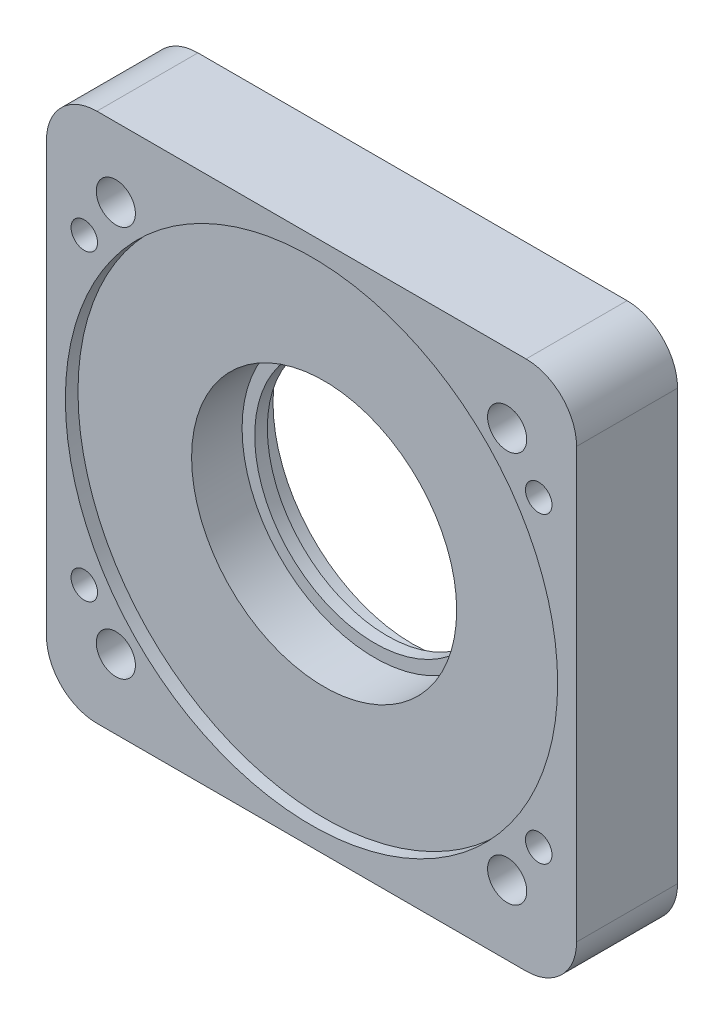
ISO-10303-21;
HEADER;
FILE_DESCRIPTION(('STEP AP214'),'2;1');
FILE_NAME('part.step','',(''),(''),'','','');
FILE_SCHEMA(('AUTOMOTIVE_DESIGN { 1 0 10303 214 1 1 1 1 }'));
ENDSEC;
DATA;
#1=APPLICATION_CONTEXT('core data for automotive mechanical design processes');
#2=APPLICATION_PROTOCOL_DEFINITION('international standard','automotive_design',2000,#1);
#3=PRODUCT_CONTEXT('',#1,'mechanical');
#4=PRODUCT('Part','Part','',(#3));
#5=PRODUCT_RELATED_PRODUCT_CATEGORY('part','',(#4));
#6=PRODUCT_DEFINITION_FORMATION('','',#4);
#7=PRODUCT_DEFINITION_CONTEXT('part definition',#1,'design');
#8=PRODUCT_DEFINITION('design','',#6,#7);
#9=PRODUCT_DEFINITION_SHAPE('','',#8);
#10=(LENGTH_UNIT() NAMED_UNIT(*) SI_UNIT(.MILLI.,.METRE.));
#11=(NAMED_UNIT(*) PLANE_ANGLE_UNIT() SI_UNIT($,.RADIAN.));
#12=(NAMED_UNIT(*) SI_UNIT($,.STERADIAN.) SOLID_ANGLE_UNIT());
#13=UNCERTAINTY_MEASURE_WITH_UNIT(LENGTH_MEASURE(1.E-05),#10,'distance_accuracy_value','');
#14=(GEOMETRIC_REPRESENTATION_CONTEXT(3) GLOBAL_UNCERTAINTY_ASSIGNED_CONTEXT((#13)) GLOBAL_UNIT_ASSIGNED_CONTEXT((#10,
#11,#12)) REPRESENTATION_CONTEXT('',''));
#15=CARTESIAN_POINT('',(0.,0.,0.));
#16=DIRECTION('',(0.,0.,1.));
#17=DIRECTION('',(1.,0.,0.));
#18=AXIS2_PLACEMENT_3D('',#15,#16,#17);
#19=CARTESIAN_POINT('',(18.,-12.,8.));
#20=DIRECTION('',(0.,0.,-1.));
#21=DIRECTION('',(-1.,0.,0.));
#22=AXIS2_PLACEMENT_3D('',#19,#20,#21);
#23=CYLINDRICAL_SURFACE('',#22,1.55);
#24=CARTESIAN_POINT('',(18.,-12.,0.));
#25=DIRECTION('',(0.,0.,-1.));
#26=DIRECTION('',(1.,0.,0.));
#27=AXIS2_PLACEMENT_3D('',#24,#25,#26);
#28=CIRCLE('',#27,1.55);
#29=CARTESIAN_POINT('',(19.55,-12.,0.));
#30=VERTEX_POINT('',#29);
#31=EDGE_CURVE('E338',#30,#30,#28,.T.);
#32=ORIENTED_EDGE('',*,*,#31,.T.);
#33=EDGE_LOOP('',(#32));
#34=FACE_BOUND('',#33,.T.);
#35=CARTESIAN_POINT('',(18.,-12.,6.));
#36=DIRECTION('',(0.,0.,1.));
#37=DIRECTION('',(1.,0.,0.));
#38=AXIS2_PLACEMENT_3D('',#35,#36,#37);
#39=CIRCLE('',#38,1.55);
#40=CARTESIAN_POINT('',(19.55,-12.,6.));
#41=VERTEX_POINT('',#40);
#42=EDGE_CURVE('E12',#41,#41,#39,.F.);
#43=ORIENTED_EDGE('',*,*,#42,.F.);
#44=EDGE_LOOP('',(#43));
#45=FACE_BOUND('',#44,.T.);
#46=ADVANCED_FACE('F44',(#34,#45),#23,.F.);
#47=CARTESIAN_POINT('',(-18.,12.,8.));
#48=DIRECTION('',(0.,0.,-1.));
#49=DIRECTION('',(-1.,0.,0.));
#50=AXIS2_PLACEMENT_3D('',#47,#48,#49);
#51=CYLINDRICAL_SURFACE('',#50,1.55);
#52=CARTESIAN_POINT('',(-18.,12.,0.));
#53=DIRECTION('',(0.,0.,-1.));
#54=DIRECTION('',(1.,0.,0.));
#55=AXIS2_PLACEMENT_3D('',#52,#53,#54);
#56=CIRCLE('',#55,1.55);
#57=CARTESIAN_POINT('',(-16.45,12.,0.));
#58=VERTEX_POINT('',#57);
#59=EDGE_CURVE('E337',#58,#58,#56,.T.);
#60=ORIENTED_EDGE('',*,*,#59,.T.);
#61=EDGE_LOOP('',(#60));
#62=FACE_BOUND('',#61,.T.);
#63=CARTESIAN_POINT('',(-18.,12.,6.));
#64=DIRECTION('',(0.,0.,1.));
#65=DIRECTION('',(1.,0.,0.));
#66=AXIS2_PLACEMENT_3D('',#63,#64,#65);
#67=CIRCLE('',#66,1.55);
#68=CARTESIAN_POINT('',(-16.45,12.,6.));
#69=VERTEX_POINT('',#68);
#70=EDGE_CURVE('E52',#69,#69,#67,.F.);
#71=ORIENTED_EDGE('',*,*,#70,.F.);
#72=EDGE_LOOP('',(#71));
#73=FACE_BOUND('',#72,.T.);
#74=ADVANCED_FACE('F190',(#62,#73),#51,.F.);
#75=CARTESIAN_POINT('',(0.,0.,-29.698484809835));
#76=DIRECTION('',(0.,0.,1.));
#77=DIRECTION('',(1.,0.,0.));
#78=AXIS2_PLACEMENT_3D('',#75,#76,#77);
#79=CYLINDRICAL_SURFACE('',#78,10.5);
#80=CARTESIAN_POINT('',(0.,0.,3.));
#81=DIRECTION('',(0.,0.,1.));
#82=DIRECTION('',(1.,0.,0.));
#83=AXIS2_PLACEMENT_3D('',#80,#81,#82);
#84=CIRCLE('',#83,10.5);
#85=CARTESIAN_POINT('',(10.5,0.,3.));
#86=VERTEX_POINT('',#85);
#87=EDGE_CURVE('E144',#86,#86,#84,.F.);
#88=ORIENTED_EDGE('',*,*,#87,.T.);
#89=EDGE_LOOP('',(#88));
#90=FACE_BOUND('',#89,.T.);
#91=CARTESIAN_POINT('',(0.,0.,7.));
#92=DIRECTION('',(0.,0.,1.));
#93=DIRECTION('',(1.,0.,0.));
#94=AXIS2_PLACEMENT_3D('',#91,#92,#93);
#95=CIRCLE('',#94,10.5);
#96=CARTESIAN_POINT('',(10.5,0.,7.));
#97=VERTEX_POINT('',#96);
#98=EDGE_CURVE('E181',#97,#97,#95,.F.);
#99=ORIENTED_EDGE('',*,*,#98,.F.);
#100=EDGE_LOOP('',(#99));
#101=FACE_BOUND('',#100,.T.);
#102=ADVANCED_FACE('F192',(#90,#101),#79,.F.);
#103=CARTESIAN_POINT('',(0.,0.,0.));
#104=DIRECTION('',(0.,0.,1.));
#105=DIRECTION('',(1.,0.,0.));
#106=AXIS2_PLACEMENT_3D('',#103,#104,#105);
#107=CYLINDRICAL_SURFACE('',#106,9.5);
#108=CARTESIAN_POINT('',(0.,0.,3.));
#109=DIRECTION('',(0.,0.,1.));
#110=DIRECTION('',(1.,0.,0.));
#111=AXIS2_PLACEMENT_3D('',#108,#109,#110);
#112=CIRCLE('',#111,9.5);
#113=CARTESIAN_POINT('',(9.5,0.,3.));
#114=VERTEX_POINT('',#113);
#115=EDGE_CURVE('E138',#114,#114,#112,.F.);
#116=ORIENTED_EDGE('',*,*,#115,.F.);
#117=EDGE_LOOP('',(#116));
#118=FACE_BOUND('',#117,.T.);
#119=CARTESIAN_POINT('',(0.,0.,2.));
#120=DIRECTION('',(0.,0.,-1.));
#121=DIRECTION('',(-1.,0.,0.));
#122=AXIS2_PLACEMENT_3D('',#119,#120,#121);
#123=CIRCLE('',#122,9.5);
#124=CARTESIAN_POINT('',(-9.5,0.,2.));
#125=VERTEX_POINT('',#124);
#126=EDGE_CURVE('E153',#125,#125,#123,.F.);
#127=ORIENTED_EDGE('',*,*,#126,.F.);
#128=EDGE_LOOP('',(#127));
#129=FACE_BOUND('',#128,.T.);
#130=ADVANCED_FACE('F199',(#118,#129),#107,.F.);
#131=CARTESIAN_POINT('',(21.,21.,8.));
#132=DIRECTION('',(-1.,0.,0.));
#133=DIRECTION('',(0.,0.,1.));
#134=AXIS2_PLACEMENT_3D('',#131,#132,#133);
#135=PLANE('',#134);
#136=DIRECTION('',(0.,1.,0.));
#137=VECTOR('',#136,1.);
#138=CARTESIAN_POINT('',(21.,21.,8.));
#139=LINE('',#138,#137);
#140=CARTESIAN_POINT('',(21.,-17.,8.));
#141=VERTEX_POINT('',#140);
#142=CARTESIAN_POINT('',(21.,17.,8.));
#143=VERTEX_POINT('',#142);
#144=EDGE_CURVE('E131',#141,#143,#139,.T.);
#145=ORIENTED_EDGE('',*,*,#144,.F.);
#146=DIRECTION('',(0.,0.,-1.));
#147=VECTOR('',#146,1.);
#148=CARTESIAN_POINT('',(21.,-17.,8.));
#149=LINE('',#148,#147);
#150=CARTESIAN_POINT('',(21.,-17.,0.));
#151=VERTEX_POINT('',#150);
#152=EDGE_CURVE('E115',#141,#151,#149,.T.);
#153=ORIENTED_EDGE('',*,*,#152,.T.);
#154=DIRECTION('',(0.,1.,0.));
#155=VECTOR('',#154,1.);
#156=CARTESIAN_POINT('',(21.,21.,0.));
#157=LINE('',#156,#155);
#158=CARTESIAN_POINT('',(21.,17.,0.));
#159=VERTEX_POINT('',#158);
#160=EDGE_CURVE('E128',#151,#159,#157,.T.);
#161=ORIENTED_EDGE('',*,*,#160,.T.);
#162=DIRECTION('',(0.,0.,-1.));
#163=VECTOR('',#162,1.);
#164=CARTESIAN_POINT('',(21.,17.,8.));
#165=LINE('',#164,#163);
#166=EDGE_CURVE('E133',#159,#143,#165,.F.);
#167=ORIENTED_EDGE('',*,*,#166,.T.);
#168=EDGE_LOOP('',(#145,#153,#161,#167));
#169=FACE_BOUND('',#168,.T.);
#170=ADVANCED_FACE('F127',(#169),#135,.F.);
#171=CARTESIAN_POINT('',(-21.,21.,8.));
#172=DIRECTION('',(0.,-1.,0.));
#173=DIRECTION('',(0.,0.,-1.));
#174=AXIS2_PLACEMENT_3D('',#171,#172,#173);
#175=PLANE('',#174);
#176=DIRECTION('',(-1.,0.,0.));
#177=VECTOR('',#176,1.);
#178=CARTESIAN_POINT('',(-21.,21.,8.));
#179=LINE('',#178,#177);
#180=CARTESIAN_POINT('',(17.,21.,8.));
#181=VERTEX_POINT('',#180);
#182=CARTESIAN_POINT('',(-17.,21.,8.));
#183=VERTEX_POINT('',#182);
#184=EDGE_CURVE('E295',#181,#183,#179,.T.);
#185=ORIENTED_EDGE('',*,*,#184,.F.);
#186=DIRECTION('',(0.,0.,-1.));
#187=VECTOR('',#186,1.);
#188=CARTESIAN_POINT('',(17.,21.,8.));
#189=LINE('',#188,#187);
#190=CARTESIAN_POINT('',(17.,21.,0.));
#191=VERTEX_POINT('',#190);
#192=EDGE_CURVE('E174',#181,#191,#189,.T.);
#193=ORIENTED_EDGE('',*,*,#192,.T.);
#194=DIRECTION('',(-1.,0.,0.));
#195=VECTOR('',#194,1.);
#196=CARTESIAN_POINT('',(-21.,21.,0.));
#197=LINE('',#196,#195);
#198=CARTESIAN_POINT('',(-17.,21.,0.));
#199=VERTEX_POINT('',#198);
#200=EDGE_CURVE('E137',#191,#199,#197,.T.);
#201=ORIENTED_EDGE('',*,*,#200,.T.);
#202=DIRECTION('',(0.,0.,-1.));
#203=VECTOR('',#202,1.);
#204=CARTESIAN_POINT('',(-17.,21.,8.));
#205=LINE('',#204,#203);
#206=EDGE_CURVE('E172',#199,#183,#205,.F.);
#207=ORIENTED_EDGE('',*,*,#206,.T.);
#208=EDGE_LOOP('',(#185,#193,#201,#207));
#209=FACE_BOUND('',#208,.T.);
#210=ADVANCED_FACE('F269',(#209),#175,.F.);
#211=CARTESIAN_POINT('',(-21.,21.,8.));
#212=DIRECTION('',(1.,0.,0.));
#213=DIRECTION('',(0.,0.,-1.));
#214=AXIS2_PLACEMENT_3D('',#211,#212,#213);
#215=PLANE('',#214);
#216=DIRECTION('',(0.,-1.,0.));
#217=VECTOR('',#216,1.);
#218=CARTESIAN_POINT('',(-21.,21.,8.));
#219=LINE('',#218,#217);
#220=CARTESIAN_POINT('',(-21.,17.,8.));
#221=VERTEX_POINT('',#220);
#222=CARTESIAN_POINT('',(-21.,-17.,8.));
#223=VERTEX_POINT('',#222);
#224=EDGE_CURVE('E290',#221,#223,#219,.T.);
#225=ORIENTED_EDGE('',*,*,#224,.F.);
#226=DIRECTION('',(0.,0.,-1.));
#227=VECTOR('',#226,1.);
#228=CARTESIAN_POINT('',(-21.,17.,8.));
#229=LINE('',#228,#227);
#230=CARTESIAN_POINT('',(-21.,17.,0.));
#231=VERTEX_POINT('',#230);
#232=EDGE_CURVE('E178',#221,#231,#229,.T.);
#233=ORIENTED_EDGE('',*,*,#232,.T.);
#234=DIRECTION('',(0.,-1.,0.));
#235=VECTOR('',#234,1.);
#236=CARTESIAN_POINT('',(-21.,21.,0.));
#237=LINE('',#236,#235);
#238=CARTESIAN_POINT('',(-21.,-17.,0.));
#239=VERTEX_POINT('',#238);
#240=EDGE_CURVE('E141',#231,#239,#237,.T.);
#241=ORIENTED_EDGE('',*,*,#240,.T.);
#242=DIRECTION('',(0.,0.,-1.));
#243=VECTOR('',#242,1.);
#244=CARTESIAN_POINT('',(-21.,-17.,8.));
#245=LINE('',#244,#243);
#246=EDGE_CURVE('E59',#239,#223,#245,.F.);
#247=ORIENTED_EDGE('',*,*,#246,.T.);
#248=EDGE_LOOP('',(#225,#233,#241,#247));
#249=FACE_BOUND('',#248,.T.);
#250=ADVANCED_FACE('F265',(#249),#215,.F.);
#251=CARTESIAN_POINT('',(-21.,-21.,8.));
#252=DIRECTION('',(0.,1.,0.));
#253=DIRECTION('',(0.,0.,1.));
#254=AXIS2_PLACEMENT_3D('',#251,#252,#253);
#255=PLANE('',#254);
#256=DIRECTION('',(1.,0.,0.));
#257=VECTOR('',#256,1.);
#258=CARTESIAN_POINT('',(-21.,-21.,0.));
#259=LINE('',#258,#257);
#260=CARTESIAN_POINT('',(-17.,-21.,0.));
#261=VERTEX_POINT('',#260);
#262=CARTESIAN_POINT('',(17.,-21.,0.));
#263=VERTEX_POINT('',#262);
#264=EDGE_CURVE('E151',#261,#263,#259,.T.);
#265=ORIENTED_EDGE('',*,*,#264,.T.);
#266=DIRECTION('',(0.,0.,-1.));
#267=VECTOR('',#266,1.);
#268=CARTESIAN_POINT('',(17.,-21.,8.));
#269=LINE('',#268,#267);
#270=CARTESIAN_POINT('',(17.,-21.,8.));
#271=VERTEX_POINT('',#270);
#272=EDGE_CURVE('E116',#263,#271,#269,.F.);
#273=ORIENTED_EDGE('',*,*,#272,.T.);
#274=DIRECTION('',(1.,0.,0.));
#275=VECTOR('',#274,1.);
#276=CARTESIAN_POINT('',(-21.,-21.,8.));
#277=LINE('',#276,#275);
#278=CARTESIAN_POINT('',(-17.,-21.,8.));
#279=VERTEX_POINT('',#278);
#280=EDGE_CURVE('E147',#279,#271,#277,.T.);
#281=ORIENTED_EDGE('',*,*,#280,.F.);
#282=DIRECTION('',(0.,0.,-1.));
#283=VECTOR('',#282,1.);
#284=CARTESIAN_POINT('',(-17.,-21.,8.));
#285=LINE('',#284,#283);
#286=EDGE_CURVE('E121',#279,#261,#285,.T.);
#287=ORIENTED_EDGE('',*,*,#286,.T.);
#288=EDGE_LOOP('',(#265,#273,#281,#287));
#289=FACE_BOUND('',#288,.T.);
#290=ADVANCED_FACE('F258',(#289),#255,.F.);
#291=CARTESIAN_POINT('',(0.,0.,8.));
#292=DIRECTION('',(0.,0.,1.));
#293=DIRECTION('',(1.,0.,0.));
#294=AXIS2_PLACEMENT_3D('',#291,#292,#293);
#295=PLANE('',#294);
#296=CARTESIAN_POINT('',(15.4999999999997,-15.4999999999997,8.));
#297=DIRECTION('',(0.,0.,-1.));
#298=DIRECTION('',(-1.,0.,0.));
#299=AXIS2_PLACEMENT_3D('',#296,#297,#298);
#300=CIRCLE('',#299,1.55);
#301=CARTESIAN_POINT('',(13.9499999999997,-15.4999999999997,8.));
#302=VERTEX_POINT('',#301);
#303=EDGE_CURVE('E317',#302,#302,#300,.T.);
#304=ORIENTED_EDGE('',*,*,#303,.T.);
#305=EDGE_LOOP('',(#304));
#306=FACE_BOUND('',#305,.T.);
#307=CARTESIAN_POINT('',(-15.5000000000003,-15.4999999999997,8.));
#308=DIRECTION('',(0.,0.,-1.));
#309=DIRECTION('',(-1.,0.,0.));
#310=AXIS2_PLACEMENT_3D('',#307,#308,#309);
#311=CIRCLE('',#310,1.55);
#312=CARTESIAN_POINT('',(-17.0500000000003,-15.4999999999997,8.));
#313=VERTEX_POINT('',#312);
#314=EDGE_CURVE('E324',#313,#313,#311,.T.);
#315=ORIENTED_EDGE('',*,*,#314,.T.);
#316=EDGE_LOOP('',(#315));
#317=FACE_BOUND('',#316,.T.);
#318=CARTESIAN_POINT('',(-15.5000000000003,15.5000000000003,8.));
#319=DIRECTION('',(0.,0.,-1.));
#320=DIRECTION('',(-1.,0.,0.));
#321=AXIS2_PLACEMENT_3D('',#318,#319,#320);
#322=CIRCLE('',#321,1.55);
#323=CARTESIAN_POINT('',(-17.0500000000003,15.5000000000003,8.));
#324=VERTEX_POINT('',#323);
#325=EDGE_CURVE('E330',#324,#324,#322,.T.);
#326=ORIENTED_EDGE('',*,*,#325,.T.);
#327=EDGE_LOOP('',(#326));
#328=FACE_BOUND('',#327,.T.);
#329=CARTESIAN_POINT('',(15.4999999999997,15.5000000000003,8.));
#330=DIRECTION('',(0.,0.,-1.));
#331=DIRECTION('',(-1.,0.,0.));
#332=AXIS2_PLACEMENT_3D('',#329,#330,#331);
#333=CIRCLE('',#332,1.55);
#334=CARTESIAN_POINT('',(13.9499999999997,15.5000000000003,8.));
#335=VERTEX_POINT('',#334);
#336=EDGE_CURVE('E308',#335,#335,#333,.T.);
#337=ORIENTED_EDGE('',*,*,#336,.T.);
#338=EDGE_LOOP('',(#337));
#339=FACE_BOUND('',#338,.T.);
#340=CARTESIAN_POINT('',(0.,0.,8.));
#341=DIRECTION('',(0.,0.,1.));
#342=DIRECTION('',(1.,0.,0.));
#343=AXIS2_PLACEMENT_3D('',#340,#341,#342);
#344=CIRCLE('',#343,19.5);
#345=CARTESIAN_POINT('',(19.5,0.,8.));
#346=VERTEX_POINT('',#345);
#347=EDGE_CURVE('E305',#346,#346,#344,.T.);
#348=ORIENTED_EDGE('',*,*,#347,.F.);
#349=EDGE_LOOP('',(#348));
#350=FACE_BOUND('',#349,.T.);
#351=ORIENTED_EDGE('',*,*,#280,.T.);
#352=CARTESIAN_POINT('',(17.,-17.,8.));
#353=DIRECTION('',(0.,0.,1.));
#354=DIRECTION('',(1.,0.,0.));
#355=AXIS2_PLACEMENT_3D('',#352,#353,#354);
#356=CIRCLE('',#355,4.);
#357=EDGE_CURVE('E170',#271,#141,#356,.T.);
#358=ORIENTED_EDGE('',*,*,#357,.T.);
#359=ORIENTED_EDGE('',*,*,#144,.T.);
#360=CARTESIAN_POINT('',(17.,17.,8.));
#361=DIRECTION('',(0.,0.,1.));
#362=DIRECTION('',(1.,0.,0.));
#363=AXIS2_PLACEMENT_3D('',#360,#361,#362);
#364=CIRCLE('',#363,4.);
#365=EDGE_CURVE('E168',#143,#181,#364,.T.);
#366=ORIENTED_EDGE('',*,*,#365,.T.);
#367=ORIENTED_EDGE('',*,*,#184,.T.);
#368=CARTESIAN_POINT('',(-17.,17.,8.));
#369=DIRECTION('',(0.,0.,1.));
#370=DIRECTION('',(1.,0.,0.));
#371=AXIS2_PLACEMENT_3D('',#368,#369,#370);
#372=CIRCLE('',#371,4.);
#373=EDGE_CURVE('E66',#183,#221,#372,.T.);
#374=ORIENTED_EDGE('',*,*,#373,.T.);
#375=ORIENTED_EDGE('',*,*,#224,.T.);
#376=CARTESIAN_POINT('',(-17.,-17.,8.));
#377=DIRECTION('',(0.,0.,1.));
#378=DIRECTION('',(1.,0.,0.));
#379=AXIS2_PLACEMENT_3D('',#376,#377,#378);
#380=CIRCLE('',#379,4.);
#381=EDGE_CURVE('E165',#223,#279,#380,.T.);
#382=ORIENTED_EDGE('',*,*,#381,.T.);
#383=EDGE_LOOP('',(#351,#358,#359,#366,#367,#374,#375,#382));
#384=FACE_BOUND('',#383,.T.);
#385=CARTESIAN_POINT('',(-18.,12.,8.));
#386=DIRECTION('',(0.,0.,1.));
#387=DIRECTION('',(1.,0.,0.));
#388=AXIS2_PLACEMENT_3D('',#385,#386,#387);
#389=CIRCLE('',#388,1.05);
#390=CARTESIAN_POINT('',(-16.95,12.,8.));
#391=VERTEX_POINT('',#390);
#392=EDGE_CURVE('E346',#391,#391,#389,.T.);
#393=ORIENTED_EDGE('',*,*,#392,.F.);
#394=EDGE_LOOP('',(#393));
#395=FACE_BOUND('',#394,.T.);
#396=CARTESIAN_POINT('',(18.,12.,8.));
#397=DIRECTION('',(0.,0.,1.));
#398=DIRECTION('',(-1.,0.,0.));
#399=AXIS2_PLACEMENT_3D('',#396,#397,#398);
#400=CIRCLE('',#399,1.05);
#401=CARTESIAN_POINT('',(16.95,12.,8.));
#402=VERTEX_POINT('',#401);
#403=EDGE_CURVE('E349',#402,#402,#400,.T.);
#404=ORIENTED_EDGE('',*,*,#403,.F.);
#405=EDGE_LOOP('',(#404));
#406=FACE_BOUND('',#405,.T.);
#407=CARTESIAN_POINT('',(18.,-12.,8.));
#408=DIRECTION('',(0.,0.,1.));
#409=DIRECTION('',(1.,0.,0.));
#410=AXIS2_PLACEMENT_3D('',#407,#408,#409);
#411=CIRCLE('',#410,1.05);
#412=CARTESIAN_POINT('',(19.05,-12.,8.));
#413=VERTEX_POINT('',#412);
#414=EDGE_CURVE('E360',#413,#413,#411,.T.);
#415=ORIENTED_EDGE('',*,*,#414,.F.);
#416=EDGE_LOOP('',(#415));
#417=FACE_BOUND('',#416,.T.);
#418=CARTESIAN_POINT('',(-18.,-12.,8.));
#419=DIRECTION('',(0.,0.,1.));
#420=DIRECTION('',(-1.,0.,0.));
#421=AXIS2_PLACEMENT_3D('',#418,#419,#420);
#422=CIRCLE('',#421,1.05);
#423=CARTESIAN_POINT('',(-19.05,-12.,8.));
#424=VERTEX_POINT('',#423);
#425=EDGE_CURVE('E364',#424,#424,#422,.T.);
#426=ORIENTED_EDGE('',*,*,#425,.F.);
#427=EDGE_LOOP('',(#426));
#428=FACE_BOUND('',#427,.T.);
#429=ADVANCED_FACE('F255',(#306,#317,#328,#339,#350,#384,#395,#406,#417,#428),#295,.T.);
#430=CARTESIAN_POINT('',(0.,0.,0.));
#431=DIRECTION('',(0.,0.,1.));
#432=DIRECTION('',(1.,0.,0.));
#433=AXIS2_PLACEMENT_3D('',#430,#431,#432);
#434=PLANE('',#433);
#435=ORIENTED_EDGE('',*,*,#31,.F.);
#436=EDGE_LOOP('',(#435));
#437=FACE_BOUND('',#436,.T.);
#438=CARTESIAN_POINT('',(-18.,-12.,0.));
#439=DIRECTION('',(0.,0.,-1.));
#440=DIRECTION('',(-1.,0.,0.));
#441=AXIS2_PLACEMENT_3D('',#438,#439,#440);
#442=CIRCLE('',#441,1.55);
#443=CARTESIAN_POINT('',(-19.55,-12.,0.));
#444=VERTEX_POINT('',#443);
#445=EDGE_CURVE('E341',#444,#444,#442,.T.);
#446=ORIENTED_EDGE('',*,*,#445,.F.);
#447=EDGE_LOOP('',(#446));
#448=FACE_BOUND('',#447,.T.);
#449=ORIENTED_EDGE('',*,*,#59,.F.);
#450=EDGE_LOOP('',(#449));
#451=FACE_BOUND('',#450,.T.);
#452=CARTESIAN_POINT('',(18.,12.,0.));
#453=DIRECTION('',(0.,0.,-1.));
#454=DIRECTION('',(-1.,0.,0.));
#455=AXIS2_PLACEMENT_3D('',#452,#453,#454);
#456=CIRCLE('',#455,1.55);
#457=CARTESIAN_POINT('',(16.45,12.,0.));
#458=VERTEX_POINT('',#457);
#459=EDGE_CURVE('E321',#458,#458,#456,.T.);
#460=ORIENTED_EDGE('',*,*,#459,.F.);
#461=EDGE_LOOP('',(#460));
#462=FACE_BOUND('',#461,.T.);
#463=CARTESIAN_POINT('',(15.4999999999997,-15.4999999999997,0.));
#464=DIRECTION('',(0.,0.,-1.));
#465=DIRECTION('',(-1.,0.,0.));
#466=AXIS2_PLACEMENT_3D('',#463,#464,#465);
#467=CIRCLE('',#466,1.55);
#468=CARTESIAN_POINT('',(13.9499999999997,-15.4999999999997,0.));
#469=VERTEX_POINT('',#468);
#470=EDGE_CURVE('E320',#469,#469,#467,.T.);
#471=ORIENTED_EDGE('',*,*,#470,.F.);
#472=EDGE_LOOP('',(#471));
#473=FACE_BOUND('',#472,.T.);
#474=CARTESIAN_POINT('',(-15.5000000000003,-15.4999999999997,0.));
#475=DIRECTION('',(0.,0.,-1.));
#476=DIRECTION('',(-1.,0.,0.));
#477=AXIS2_PLACEMENT_3D('',#474,#475,#476);
#478=CIRCLE('',#477,1.55);
#479=CARTESIAN_POINT('',(-17.0500000000003,-15.4999999999997,0.));
#480=VERTEX_POINT('',#479);
#481=EDGE_CURVE('E327',#480,#480,#478,.T.);
#482=ORIENTED_EDGE('',*,*,#481,.F.);
#483=EDGE_LOOP('',(#482));
#484=FACE_BOUND('',#483,.T.);
#485=CARTESIAN_POINT('',(-15.5000000000003,15.5000000000003,0.));
#486=DIRECTION('',(0.,0.,-1.));
#487=DIRECTION('',(-1.,0.,0.));
#488=AXIS2_PLACEMENT_3D('',#485,#486,#487);
#489=CIRCLE('',#488,1.55);
#490=CARTESIAN_POINT('',(-17.0500000000003,15.5000000000003,0.));
#491=VERTEX_POINT('',#490);
#492=EDGE_CURVE('E314',#491,#491,#489,.T.);
#493=ORIENTED_EDGE('',*,*,#492,.F.);
#494=EDGE_LOOP('',(#493));
#495=FACE_BOUND('',#494,.T.);
#496=CARTESIAN_POINT('',(15.4999999999997,15.5000000000003,0.));
#497=DIRECTION('',(0.,0.,-1.));
#498=DIRECTION('',(-1.,0.,0.));
#499=AXIS2_PLACEMENT_3D('',#496,#497,#498);
#500=CIRCLE('',#499,1.55);
#501=CARTESIAN_POINT('',(13.9499999999997,15.5000000000003,0.));
#502=VERTEX_POINT('',#501);
#503=EDGE_CURVE('E311',#502,#502,#500,.T.);
#504=ORIENTED_EDGE('',*,*,#503,.F.);
#505=EDGE_LOOP('',(#504));
#506=FACE_BOUND('',#505,.T.);
#507=CARTESIAN_POINT('',(0.,0.,0.));
#508=DIRECTION('',(0.,0.,-1.));
#509=DIRECTION('',(-1.,0.,0.));
#510=AXIS2_PLACEMENT_3D('',#507,#508,#509);
#511=CIRCLE('',#510,11.05);
#512=CARTESIAN_POINT('',(-11.05,0.,0.));
#513=VERTEX_POINT('',#512);
#514=EDGE_CURVE('E183',#513,#513,#511,.T.);
#515=ORIENTED_EDGE('',*,*,#514,.F.);
#516=EDGE_LOOP('',(#515));
#517=FACE_BOUND('',#516,.T.);
#518=ORIENTED_EDGE('',*,*,#160,.F.);
#519=CARTESIAN_POINT('',(17.,-17.,0.));
#520=DIRECTION('',(0.,0.,1.));
#521=DIRECTION('',(1.,0.,0.));
#522=AXIS2_PLACEMENT_3D('',#519,#520,#521);
#523=CIRCLE('',#522,4.);
#524=EDGE_CURVE('E111',#151,#263,#523,.F.);
#525=ORIENTED_EDGE('',*,*,#524,.T.);
#526=ORIENTED_EDGE('',*,*,#264,.F.);
#527=CARTESIAN_POINT('',(-17.,-17.,0.));
#528=DIRECTION('',(0.,0.,1.));
#529=DIRECTION('',(1.,0.,0.));
#530=AXIS2_PLACEMENT_3D('',#527,#528,#529);
#531=CIRCLE('',#530,4.);
#532=EDGE_CURVE('E132',#261,#239,#531,.F.);
#533=ORIENTED_EDGE('',*,*,#532,.T.);
#534=ORIENTED_EDGE('',*,*,#240,.F.);
#535=CARTESIAN_POINT('',(-17.,17.,0.));
#536=DIRECTION('',(0.,0.,1.));
#537=DIRECTION('',(1.,0.,0.));
#538=AXIS2_PLACEMENT_3D('',#535,#536,#537);
#539=CIRCLE('',#538,4.);
#540=EDGE_CURVE('E159',#231,#199,#539,.F.);
#541=ORIENTED_EDGE('',*,*,#540,.T.);
#542=ORIENTED_EDGE('',*,*,#200,.F.);
#543=CARTESIAN_POINT('',(17.,17.,0.));
#544=DIRECTION('',(0.,0.,1.));
#545=DIRECTION('',(1.,0.,0.));
#546=AXIS2_PLACEMENT_3D('',#543,#544,#545);
#547=CIRCLE('',#546,4.);
#548=EDGE_CURVE('E122',#191,#159,#547,.F.);
#549=ORIENTED_EDGE('',*,*,#548,.T.);
#550=EDGE_LOOP('',(#518,#525,#526,#533,#534,#541,#542,#549));
#551=FACE_BOUND('',#550,.T.);
#552=ADVANCED_FACE('F135',(#437,#448,#451,#462,#473,#484,#495,#506,#517,#551),#434,.F.);
#553=CARTESIAN_POINT('',(0.,0.,3.));
#554=DIRECTION('',(0.,0.,1.));
#555=DIRECTION('',(1.,0.,0.));
#556=AXIS2_PLACEMENT_3D('',#553,#554,#555);
#557=PLANE('',#556);
#558=ORIENTED_EDGE('',*,*,#87,.F.);
#559=EDGE_LOOP('',(#558));
#560=FACE_BOUND('',#559,.T.);
#561=ORIENTED_EDGE('',*,*,#115,.T.);
#562=EDGE_LOOP('',(#561));
#563=FACE_BOUND('',#562,.T.);
#564=ADVANCED_FACE('F244',(#560,#563),#557,.T.);
#565=CARTESIAN_POINT('',(0.,0.,2.));
#566=DIRECTION('',(0.,0.,-1.));
#567=DIRECTION('',(-1.,0.,0.));
#568=AXIS2_PLACEMENT_3D('',#565,#566,#567);
#569=PLANE('',#568);
#570=CARTESIAN_POINT('',(0.,0.,2.));
#571=DIRECTION('',(0.,0.,-1.));
#572=DIRECTION('',(-1.,0.,0.));
#573=AXIS2_PLACEMENT_3D('',#570,#571,#572);
#574=CIRCLE('',#573,11.05);
#575=CARTESIAN_POINT('',(-11.05,0.,2.));
#576=VERTEX_POINT('',#575);
#577=EDGE_CURVE('E156',#576,#576,#574,.T.);
#578=ORIENTED_EDGE('',*,*,#577,.T.);
#579=EDGE_LOOP('',(#578));
#580=FACE_BOUND('',#579,.T.);
#581=ORIENTED_EDGE('',*,*,#126,.T.);
#582=EDGE_LOOP('',(#581));
#583=FACE_BOUND('',#582,.T.);
#584=ADVANCED_FACE('F240',(#580,#583),#569,.T.);
#585=CARTESIAN_POINT('',(0.,0.,2.));
#586=DIRECTION('',(0.,0.,-1.));
#587=DIRECTION('',(-1.,0.,0.));
#588=AXIS2_PLACEMENT_3D('',#585,#586,#587);
#589=CYLINDRICAL_SURFACE('',#588,11.05);
#590=ORIENTED_EDGE('',*,*,#577,.F.);
#591=EDGE_LOOP('',(#590));
#592=FACE_BOUND('',#591,.T.);
#593=ORIENTED_EDGE('',*,*,#514,.T.);
#594=EDGE_LOOP('',(#593));
#595=FACE_BOUND('',#594,.T.);
#596=ADVANCED_FACE('F243',(#592,#595),#589,.F.);
#597=CARTESIAN_POINT('',(17.,-17.,8.));
#598=DIRECTION('',(0.,0.,-1.));
#599=DIRECTION('',(-1.,0.,0.));
#600=AXIS2_PLACEMENT_3D('',#597,#598,#599);
#601=CYLINDRICAL_SURFACE('',#600,4.);
#602=ORIENTED_EDGE('',*,*,#357,.F.);
#603=ORIENTED_EDGE('',*,*,#272,.F.);
#604=ORIENTED_EDGE('',*,*,#524,.F.);
#605=ORIENTED_EDGE('',*,*,#152,.F.);
#606=EDGE_LOOP('',(#602,#603,#604,#605));
#607=FACE_BOUND('',#606,.T.);
#608=ADVANCED_FACE('F114',(#607),#601,.T.);
#609=CARTESIAN_POINT('',(17.,17.,8.));
#610=DIRECTION('',(0.,0.,-1.));
#611=DIRECTION('',(-1.,0.,0.));
#612=AXIS2_PLACEMENT_3D('',#609,#610,#611);
#613=CYLINDRICAL_SURFACE('',#612,4.);
#614=ORIENTED_EDGE('',*,*,#365,.F.);
#615=ORIENTED_EDGE('',*,*,#166,.F.);
#616=ORIENTED_EDGE('',*,*,#548,.F.);
#617=ORIENTED_EDGE('',*,*,#192,.F.);
#618=EDGE_LOOP('',(#614,#615,#616,#617));
#619=FACE_BOUND('',#618,.T.);
#620=ADVANCED_FACE('F277',(#619),#613,.T.);
#621=CARTESIAN_POINT('',(-17.,17.,8.));
#622=DIRECTION('',(0.,0.,-1.));
#623=DIRECTION('',(-1.,0.,0.));
#624=AXIS2_PLACEMENT_3D('',#621,#622,#623);
#625=CYLINDRICAL_SURFACE('',#624,4.);
#626=ORIENTED_EDGE('',*,*,#373,.F.);
#627=ORIENTED_EDGE('',*,*,#206,.F.);
#628=ORIENTED_EDGE('',*,*,#540,.F.);
#629=ORIENTED_EDGE('',*,*,#232,.F.);
#630=EDGE_LOOP('',(#626,#627,#628,#629));
#631=FACE_BOUND('',#630,.T.);
#632=ADVANCED_FACE('F279',(#631),#625,.T.);
#633=CARTESIAN_POINT('',(-17.,-17.,8.));
#634=DIRECTION('',(0.,0.,-1.));
#635=DIRECTION('',(-1.,0.,0.));
#636=AXIS2_PLACEMENT_3D('',#633,#634,#635);
#637=CYLINDRICAL_SURFACE('',#636,4.);
#638=ORIENTED_EDGE('',*,*,#381,.F.);
#639=ORIENTED_EDGE('',*,*,#246,.F.);
#640=ORIENTED_EDGE('',*,*,#532,.F.);
#641=ORIENTED_EDGE('',*,*,#286,.F.);
#642=EDGE_LOOP('',(#638,#639,#640,#641));
#643=FACE_BOUND('',#642,.T.);
#644=ADVANCED_FACE('F46',(#643),#637,.T.);
#645=CARTESIAN_POINT('',(0.,0.,7.));
#646=DIRECTION('',(0.,0.,1.));
#647=DIRECTION('',(1.,0.,0.));
#648=AXIS2_PLACEMENT_3D('',#645,#646,#647);
#649=PLANE('',#648);
#650=CARTESIAN_POINT('',(0.,0.,7.));
#651=DIRECTION('',(0.,0.,1.));
#652=DIRECTION('',(1.,0.,0.));
#653=AXIS2_PLACEMENT_3D('',#650,#651,#652);
#654=CIRCLE('',#653,19.5);
#655=CARTESIAN_POINT('',(19.5,0.,7.));
#656=VERTEX_POINT('',#655);
#657=EDGE_CURVE('E184',#656,#656,#654,.T.);
#658=ORIENTED_EDGE('',*,*,#657,.T.);
#659=EDGE_LOOP('',(#658));
#660=FACE_BOUND('',#659,.T.);
#661=ORIENTED_EDGE('',*,*,#98,.T.);
#662=EDGE_LOOP('',(#661));
#663=FACE_BOUND('',#662,.T.);
#664=ADVANCED_FACE('F233',(#660,#663),#649,.T.);
#665=CARTESIAN_POINT('',(0.,0.,7.));
#666=DIRECTION('',(0.,0.,1.));
#667=DIRECTION('',(1.,0.,0.));
#668=AXIS2_PLACEMENT_3D('',#665,#666,#667);
#669=CYLINDRICAL_SURFACE('',#668,19.5);
#670=ORIENTED_EDGE('',*,*,#657,.F.);
#671=EDGE_LOOP('',(#670));
#672=FACE_BOUND('',#671,.T.);
#673=ORIENTED_EDGE('',*,*,#347,.T.);
#674=EDGE_LOOP('',(#673));
#675=FACE_BOUND('',#674,.T.);
#676=ADVANCED_FACE('F231',(#672,#675),#669,.F.);
#677=CARTESIAN_POINT('',(15.4999999999997,15.5000000000003,8.));
#678=DIRECTION('',(0.,0.,-1.));
#679=DIRECTION('',(-1.,0.,0.));
#680=AXIS2_PLACEMENT_3D('',#677,#678,#679);
#681=CYLINDRICAL_SURFACE('',#680,1.55);
#682=ORIENTED_EDGE('',*,*,#336,.F.);
#683=EDGE_LOOP('',(#682));
#684=FACE_BOUND('',#683,.T.);
#685=ORIENTED_EDGE('',*,*,#503,.T.);
#686=EDGE_LOOP('',(#685));
#687=FACE_BOUND('',#686,.T.);
#688=ADVANCED_FACE('F221',(#684,#687),#681,.F.);
#689=CARTESIAN_POINT('',(-15.5000000000003,15.5000000000003,8.));
#690=DIRECTION('',(0.,0.,-1.));
#691=DIRECTION('',(-1.,0.,0.));
#692=AXIS2_PLACEMENT_3D('',#689,#690,#691);
#693=CYLINDRICAL_SURFACE('',#692,1.55);
#694=ORIENTED_EDGE('',*,*,#325,.F.);
#695=EDGE_LOOP('',(#694));
#696=FACE_BOUND('',#695,.T.);
#697=ORIENTED_EDGE('',*,*,#492,.T.);
#698=EDGE_LOOP('',(#697));
#699=FACE_BOUND('',#698,.T.);
#700=ADVANCED_FACE('F217',(#696,#699),#693,.F.);
#701=CARTESIAN_POINT('',(-15.5000000000003,-15.4999999999997,8.));
#702=DIRECTION('',(0.,0.,-1.));
#703=DIRECTION('',(-1.,0.,0.));
#704=AXIS2_PLACEMENT_3D('',#701,#702,#703);
#705=CYLINDRICAL_SURFACE('',#704,1.55);
#706=ORIENTED_EDGE('',*,*,#314,.F.);
#707=EDGE_LOOP('',(#706));
#708=FACE_BOUND('',#707,.T.);
#709=ORIENTED_EDGE('',*,*,#481,.T.);
#710=EDGE_LOOP('',(#709));
#711=FACE_BOUND('',#710,.T.);
#712=ADVANCED_FACE('F220',(#708,#711),#705,.F.);
#713=CARTESIAN_POINT('',(15.4999999999997,-15.4999999999997,8.));
#714=DIRECTION('',(0.,0.,-1.));
#715=DIRECTION('',(-1.,0.,0.));
#716=AXIS2_PLACEMENT_3D('',#713,#714,#715);
#717=CYLINDRICAL_SURFACE('',#716,1.55);
#718=ORIENTED_EDGE('',*,*,#303,.F.);
#719=EDGE_LOOP('',(#718));
#720=FACE_BOUND('',#719,.T.);
#721=ORIENTED_EDGE('',*,*,#470,.T.);
#722=EDGE_LOOP('',(#721));
#723=FACE_BOUND('',#722,.T.);
#724=ADVANCED_FACE('F215',(#720,#723),#717,.F.);
#725=CARTESIAN_POINT('',(18.,12.,8.));
#726=DIRECTION('',(0.,0.,-1.));
#727=DIRECTION('',(-1.,0.,0.));
#728=AXIS2_PLACEMENT_3D('',#725,#726,#727);
#729=CYLINDRICAL_SURFACE('',#728,1.55);
#730=CARTESIAN_POINT('',(18.,12.,6.));
#731=DIRECTION('',(0.,0.,1.));
#732=DIRECTION('',(-1.,0.,0.));
#733=AXIS2_PLACEMENT_3D('',#730,#731,#732);
#734=CIRCLE('',#733,1.55);
#735=CARTESIAN_POINT('',(16.45,12.,6.));
#736=VERTEX_POINT('',#735);
#737=EDGE_CURVE('E355',#736,#736,#734,.T.);
#738=ORIENTED_EDGE('',*,*,#737,.T.);
#739=EDGE_LOOP('',(#738));
#740=FACE_BOUND('',#739,.T.);
#741=ORIENTED_EDGE('',*,*,#459,.T.);
#742=EDGE_LOOP('',(#741));
#743=FACE_BOUND('',#742,.T.);
#744=ADVANCED_FACE('F210',(#740,#743),#729,.F.);
#745=CARTESIAN_POINT('',(-18.,-12.,8.));
#746=DIRECTION('',(0.,0.,-1.));
#747=DIRECTION('',(-1.,0.,0.));
#748=AXIS2_PLACEMENT_3D('',#745,#746,#747);
#749=CYLINDRICAL_SURFACE('',#748,1.55);
#750=CARTESIAN_POINT('',(-18.,-12.,6.));
#751=DIRECTION('',(0.,0.,1.));
#752=DIRECTION('',(-1.,0.,0.));
#753=AXIS2_PLACEMENT_3D('',#750,#751,#752);
#754=CIRCLE('',#753,1.55);
#755=CARTESIAN_POINT('',(-19.55,-12.,6.));
#756=VERTEX_POINT('',#755);
#757=EDGE_CURVE('E370',#756,#756,#754,.T.);
#758=ORIENTED_EDGE('',*,*,#757,.T.);
#759=EDGE_LOOP('',(#758));
#760=FACE_BOUND('',#759,.T.);
#761=ORIENTED_EDGE('',*,*,#445,.T.);
#762=EDGE_LOOP('',(#761));
#763=FACE_BOUND('',#762,.T.);
#764=ADVANCED_FACE('F208',(#760,#763),#749,.F.);
#765=CARTESIAN_POINT('',(-18.,12.,6.));
#766=DIRECTION('',(0.,0.,1.));
#767=DIRECTION('',(1.,0.,0.));
#768=AXIS2_PLACEMENT_3D('',#765,#766,#767);
#769=PLANE('',#768);
#770=CARTESIAN_POINT('',(-18.,12.,6.));
#771=DIRECTION('',(0.,0.,1.));
#772=DIRECTION('',(1.,0.,0.));
#773=AXIS2_PLACEMENT_3D('',#770,#771,#772);
#774=CIRCLE('',#773,1.05);
#775=CARTESIAN_POINT('',(-16.95,12.,6.));
#776=VERTEX_POINT('',#775);
#777=EDGE_CURVE('E342',#776,#776,#774,.T.);
#778=ORIENTED_EDGE('',*,*,#777,.T.);
#779=EDGE_LOOP('',(#778));
#780=FACE_BOUND('',#779,.T.);
#781=ORIENTED_EDGE('',*,*,#70,.T.);
#782=EDGE_LOOP('',(#781));
#783=FACE_BOUND('',#782,.T.);
#784=ADVANCED_FACE('F188',(#780,#783),#769,.F.);
#785=CARTESIAN_POINT('',(-18.,12.,6.));
#786=DIRECTION('',(0.,0.,1.));
#787=DIRECTION('',(1.,0.,0.));
#788=AXIS2_PLACEMENT_3D('',#785,#786,#787);
#789=CYLINDRICAL_SURFACE('',#788,1.05);
#790=ORIENTED_EDGE('',*,*,#777,.F.);
#791=EDGE_LOOP('',(#790));
#792=FACE_BOUND('',#791,.T.);
#793=ORIENTED_EDGE('',*,*,#392,.T.);
#794=EDGE_LOOP('',(#793));
#795=FACE_BOUND('',#794,.T.);
#796=ADVANCED_FACE('F400',(#792,#795),#789,.F.);
#797=CARTESIAN_POINT('',(18.,12.,6.));
#798=DIRECTION('',(0.,0.,-1.));
#799=DIRECTION('',(-1.,0.,0.));
#800=AXIS2_PLACEMENT_3D('',#797,#798,#799);
#801=PLANE('',#800);
#802=CARTESIAN_POINT('',(18.,12.,6.));
#803=DIRECTION('',(0.,0.,1.));
#804=DIRECTION('',(-1.,0.,0.));
#805=AXIS2_PLACEMENT_3D('',#802,#803,#804);
#806=CIRCLE('',#805,1.05);
#807=CARTESIAN_POINT('',(16.95,12.,6.));
#808=VERTEX_POINT('',#807);
#809=EDGE_CURVE('E352',#808,#808,#806,.T.);
#810=ORIENTED_EDGE('',*,*,#809,.T.);
#811=EDGE_LOOP('',(#810));
#812=FACE_BOUND('',#811,.T.);
#813=ORIENTED_EDGE('',*,*,#737,.F.);
#814=EDGE_LOOP('',(#813));
#815=FACE_BOUND('',#814,.T.);
#816=ADVANCED_FACE('F397',(#812,#815),#801,.T.);
#817=CARTESIAN_POINT('',(18.,12.,6.));
#818=DIRECTION('',(0.,0.,1.));
#819=DIRECTION('',(1.,0.,0.));
#820=AXIS2_PLACEMENT_3D('',#817,#818,#819);
#821=CYLINDRICAL_SURFACE('',#820,1.05);
#822=ORIENTED_EDGE('',*,*,#809,.F.);
#823=EDGE_LOOP('',(#822));
#824=FACE_BOUND('',#823,.T.);
#825=ORIENTED_EDGE('',*,*,#403,.T.);
#826=EDGE_LOOP('',(#825));
#827=FACE_BOUND('',#826,.T.);
#828=ADVANCED_FACE('F394',(#824,#827),#821,.F.);
#829=CARTESIAN_POINT('',(18.,-12.,6.));
#830=DIRECTION('',(0.,0.,1.));
#831=DIRECTION('',(1.,0.,0.));
#832=AXIS2_PLACEMENT_3D('',#829,#830,#831);
#833=PLANE('',#832);
#834=CARTESIAN_POINT('',(18.,-12.,6.));
#835=DIRECTION('',(0.,0.,1.));
#836=DIRECTION('',(1.,0.,0.));
#837=AXIS2_PLACEMENT_3D('',#834,#835,#836);
#838=CIRCLE('',#837,1.05);
#839=CARTESIAN_POINT('',(19.05,-12.,6.));
#840=VERTEX_POINT('',#839);
#841=EDGE_CURVE('E361',#840,#840,#838,.T.);
#842=ORIENTED_EDGE('',*,*,#841,.T.);
#843=EDGE_LOOP('',(#842));
#844=FACE_BOUND('',#843,.T.);
#845=ORIENTED_EDGE('',*,*,#42,.T.);
#846=EDGE_LOOP('',(#845));
#847=FACE_BOUND('',#846,.T.);
#848=ADVANCED_FACE('F389',(#844,#847),#833,.F.);
#849=CARTESIAN_POINT('',(18.,-12.,6.));
#850=DIRECTION('',(0.,0.,1.));
#851=DIRECTION('',(1.,0.,0.));
#852=AXIS2_PLACEMENT_3D('',#849,#850,#851);
#853=CYLINDRICAL_SURFACE('',#852,1.05);
#854=ORIENTED_EDGE('',*,*,#841,.F.);
#855=EDGE_LOOP('',(#854));
#856=FACE_BOUND('',#855,.T.);
#857=ORIENTED_EDGE('',*,*,#414,.T.);
#858=EDGE_LOOP('',(#857));
#859=FACE_BOUND('',#858,.T.);
#860=ADVANCED_FACE('F380',(#856,#859),#853,.F.);
#861=CARTESIAN_POINT('',(-18.,-12.,6.));
#862=DIRECTION('',(0.,0.,-1.));
#863=DIRECTION('',(-1.,0.,0.));
#864=AXIS2_PLACEMENT_3D('',#861,#862,#863);
#865=PLANE('',#864);
#866=CARTESIAN_POINT('',(-18.,-12.,6.));
#867=DIRECTION('',(0.,0.,1.));
#868=DIRECTION('',(-1.,0.,0.));
#869=AXIS2_PLACEMENT_3D('',#866,#867,#868);
#870=CIRCLE('',#869,1.05);
#871=CARTESIAN_POINT('',(-19.05,-12.,6.));
#872=VERTEX_POINT('',#871);
#873=EDGE_CURVE('E367',#872,#872,#870,.T.);
#874=ORIENTED_EDGE('',*,*,#873,.T.);
#875=EDGE_LOOP('',(#874));
#876=FACE_BOUND('',#875,.T.);
#877=ORIENTED_EDGE('',*,*,#757,.F.);
#878=EDGE_LOOP('',(#877));
#879=FACE_BOUND('',#878,.T.);
#880=ADVANCED_FACE('F377',(#876,#879),#865,.T.);
#881=CARTESIAN_POINT('',(-18.,-12.,6.));
#882=DIRECTION('',(0.,0.,1.));
#883=DIRECTION('',(1.,0.,0.));
#884=AXIS2_PLACEMENT_3D('',#881,#882,#883);
#885=CYLINDRICAL_SURFACE('',#884,1.05);
#886=ORIENTED_EDGE('',*,*,#873,.F.);
#887=EDGE_LOOP('',(#886));
#888=FACE_BOUND('',#887,.T.);
#889=ORIENTED_EDGE('',*,*,#425,.T.);
#890=EDGE_LOOP('',(#889));
#891=FACE_BOUND('',#890,.T.);
#892=ADVANCED_FACE('F379',(#888,#891),#885,.F.);
#893=CLOSED_SHELL('',(#46,#74,#102,#130,#170,#210,#250,#290,#429,#552,#564,#584,#596,#608,#620,
#632,#644,#664,#676,#688,#700,#712,#724,#744,#764,#784,#796,#816,#828,#848,#860,#880,#892));
#894=MANIFOLD_SOLID_BREP('B2',#893);
#895=ADVANCED_BREP_SHAPE_REPRESENTATION('',(#18,#894),#14);
#896=SHAPE_DEFINITION_REPRESENTATION(#9,#895);
ENDSEC;
END-ISO-10303-21;
